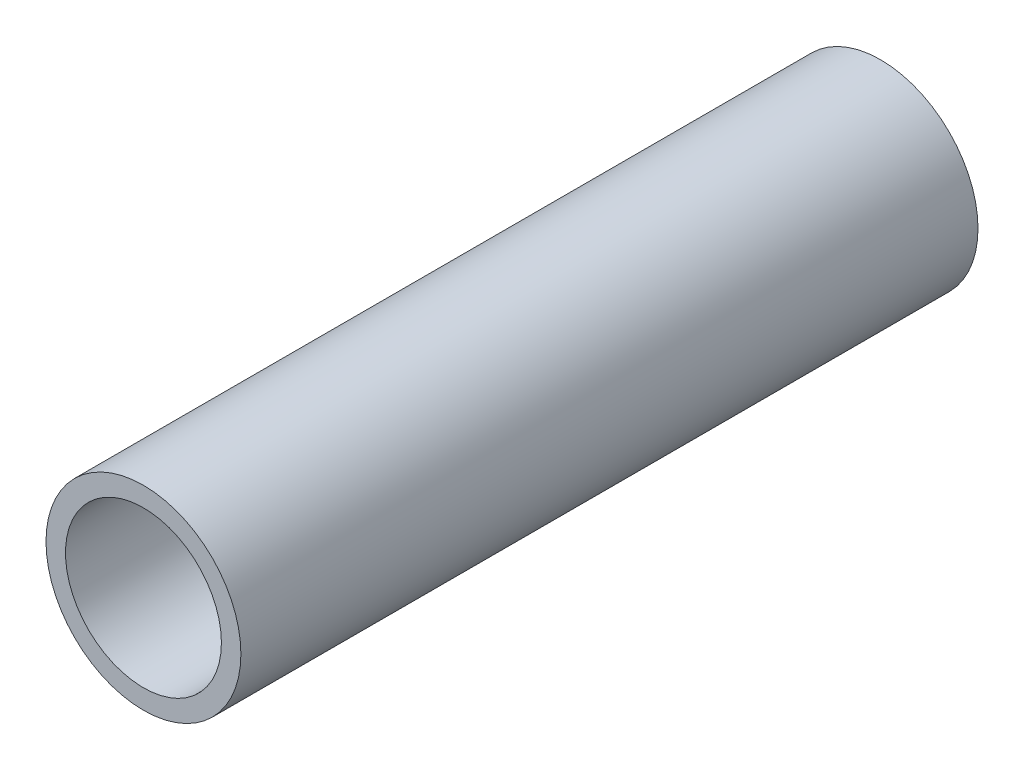
ISO-10303-21;
HEADER;
FILE_DESCRIPTION(('STEP AP214'),'2;1');
FILE_NAME('part.step','',(''),(''),'','','');
FILE_SCHEMA(('AUTOMOTIVE_DESIGN { 1 0 10303 214 1 1 1 1 }'));
ENDSEC;
DATA;
#1=APPLICATION_CONTEXT('core data for automotive mechanical design processes');
#2=APPLICATION_PROTOCOL_DEFINITION('international standard','automotive_design',2000,#1);
#3=PRODUCT_CONTEXT('',#1,'mechanical');
#4=PRODUCT('Part','Part','',(#3));
#5=PRODUCT_RELATED_PRODUCT_CATEGORY('part','',(#4));
#6=PRODUCT_DEFINITION_FORMATION('','',#4);
#7=PRODUCT_DEFINITION_CONTEXT('part definition',#1,'design');
#8=PRODUCT_DEFINITION('design','',#6,#7);
#9=PRODUCT_DEFINITION_SHAPE('','',#8);
#10=(LENGTH_UNIT() NAMED_UNIT(*) SI_UNIT(.MILLI.,.METRE.));
#11=(NAMED_UNIT(*) PLANE_ANGLE_UNIT() SI_UNIT($,.RADIAN.));
#12=(NAMED_UNIT(*) SI_UNIT($,.STERADIAN.) SOLID_ANGLE_UNIT());
#13=UNCERTAINTY_MEASURE_WITH_UNIT(LENGTH_MEASURE(1.E-05),#10,'distance_accuracy_value','');
#14=(GEOMETRIC_REPRESENTATION_CONTEXT(3) GLOBAL_UNCERTAINTY_ASSIGNED_CONTEXT((#13)) GLOBAL_UNIT_ASSIGNED_CONTEXT((#10,
#11,#12)) REPRESENTATION_CONTEXT('',''));
#15=CARTESIAN_POINT('',(0.,0.,0.));
#16=DIRECTION('',(0.,0.,1.));
#17=DIRECTION('',(1.,0.,0.));
#18=AXIS2_PLACEMENT_3D('',#15,#16,#17);
#19=CARTESIAN_POINT('',(0.,0.,9.45499999999958));
#20=DIRECTION('',(0.,0.,1.));
#21=DIRECTION('',(1.,0.,0.));
#22=AXIS2_PLACEMENT_3D('',#19,#20,#21);
#23=PLANE('',#22);
#24=CARTESIAN_POINT('',(0.,0.,9.45499999999958));
#25=DIRECTION('',(0.,0.,1.));
#26=DIRECTION('',(1.,0.,0.));
#27=AXIS2_PLACEMENT_3D('',#24,#25,#26);
#28=CIRCLE('',#27,1.25);
#29=CARTESIAN_POINT('',(1.25,0.,9.45499999999958));
#30=VERTEX_POINT('',#29);
#31=EDGE_CURVE('E10',#30,#30,#28,.T.);
#32=ORIENTED_EDGE('',*,*,#31,.T.);
#33=EDGE_LOOP('',(#32));
#34=FACE_BOUND('',#33,.T.);
#35=CARTESIAN_POINT('',(0.,0.,9.45499999999958));
#36=DIRECTION('',(0.,0.,1.));
#37=DIRECTION('',(1.,0.,0.));
#38=AXIS2_PLACEMENT_3D('',#35,#36,#37);
#39=CIRCLE('',#38,1.);
#40=CARTESIAN_POINT('',(1.,0.,9.45499999999958));
#41=VERTEX_POINT('',#40);
#42=EDGE_CURVE('E42',#41,#41,#39,.T.);
#43=ORIENTED_EDGE('',*,*,#42,.F.);
#44=EDGE_LOOP('',(#43));
#45=FACE_BOUND('',#44,.T.);
#46=ADVANCED_FACE('F31',(#34,#45),#23,.T.);
#47=CARTESIAN_POINT('',(0.,0.,0.));
#48=DIRECTION('',(0.,0.,1.));
#49=DIRECTION('',(1.,0.,0.));
#50=AXIS2_PLACEMENT_3D('',#47,#48,#49);
#51=PLANE('',#50);
#52=CARTESIAN_POINT('',(0.,0.,0.));
#53=DIRECTION('',(0.,0.,1.));
#54=DIRECTION('',(1.,0.,0.));
#55=AXIS2_PLACEMENT_3D('',#52,#53,#54);
#56=CIRCLE('',#55,1.25);
#57=CARTESIAN_POINT('',(1.25,0.,0.));
#58=VERTEX_POINT('',#57);
#59=EDGE_CURVE('E35',#58,#58,#56,.T.);
#60=ORIENTED_EDGE('',*,*,#59,.F.);
#61=EDGE_LOOP('',(#60));
#62=FACE_BOUND('',#61,.T.);
#63=CARTESIAN_POINT('',(0.,0.,0.));
#64=DIRECTION('',(0.,0.,1.));
#65=DIRECTION('',(1.,0.,0.));
#66=AXIS2_PLACEMENT_3D('',#63,#64,#65);
#67=CIRCLE('',#66,1.);
#68=CARTESIAN_POINT('',(1.,0.,0.));
#69=VERTEX_POINT('',#68);
#70=EDGE_CURVE('E44',#69,#69,#67,.T.);
#71=ORIENTED_EDGE('',*,*,#70,.T.);
#72=EDGE_LOOP('',(#71));
#73=FACE_BOUND('',#72,.T.);
#74=ADVANCED_FACE('F54',(#62,#73),#51,.F.);
#75=CARTESIAN_POINT('',(0.,0.,9.45499999999958));
#76=DIRECTION('',(0.,0.,-1.));
#77=DIRECTION('',(-1.,0.,0.));
#78=AXIS2_PLACEMENT_3D('',#75,#76,#77);
#79=CYLINDRICAL_SURFACE('',#78,1.25);
#80=ORIENTED_EDGE('',*,*,#31,.F.);
#81=EDGE_LOOP('',(#80));
#82=FACE_BOUND('',#81,.T.);
#83=ORIENTED_EDGE('',*,*,#59,.T.);
#84=EDGE_LOOP('',(#83));
#85=FACE_BOUND('',#84,.T.);
#86=ADVANCED_FACE('F33',(#82,#85),#79,.T.);
#87=CARTESIAN_POINT('',(0.,0.,9.45499999999958));
#88=DIRECTION('',(0.,0.,-1.));
#89=DIRECTION('',(-1.,0.,0.));
#90=AXIS2_PLACEMENT_3D('',#87,#88,#89);
#91=CYLINDRICAL_SURFACE('',#90,1.);
#92=ORIENTED_EDGE('',*,*,#42,.T.);
#93=EDGE_LOOP('',(#92));
#94=FACE_BOUND('',#93,.T.);
#95=ORIENTED_EDGE('',*,*,#70,.F.);
#96=EDGE_LOOP('',(#95));
#97=FACE_BOUND('',#96,.T.);
#98=ADVANCED_FACE('F50',(#94,#97),#91,.F.);
#99=CLOSED_SHELL('',(#46,#74,#86,#98));
#100=MANIFOLD_SOLID_BREP('B2',#99);
#101=ADVANCED_BREP_SHAPE_REPRESENTATION('',(#18,#100),#14);
#102=SHAPE_DEFINITION_REPRESENTATION(#9,#101);
ENDSEC;
END-ISO-10303-21;
